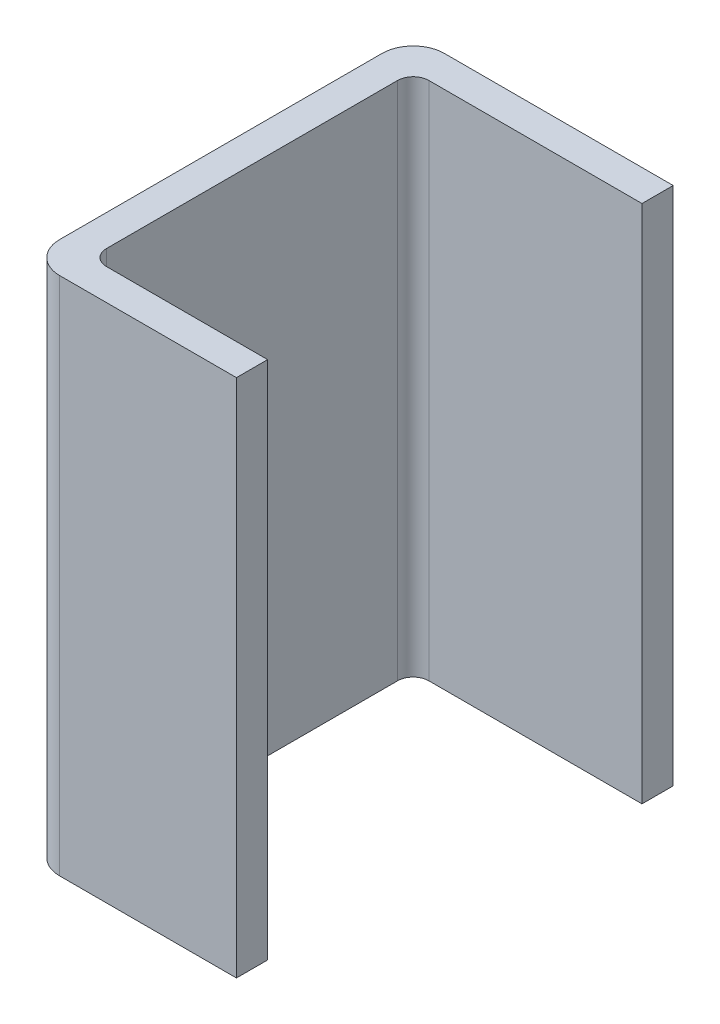
ISO-10303-21;
HEADER;
FILE_DESCRIPTION(('STEP AP214'),'2;1');
FILE_NAME('part.step','',(''),(''),'','','');
FILE_SCHEMA(('AUTOMOTIVE_DESIGN { 1 0 10303 214 1 1 1 1 }'));
ENDSEC;
DATA;
#1=APPLICATION_CONTEXT('core data for automotive mechanical design processes');
#2=APPLICATION_PROTOCOL_DEFINITION('international standard','automotive_design',2000,#1);
#3=PRODUCT_CONTEXT('',#1,'mechanical');
#4=PRODUCT('Part','Part','',(#3));
#5=PRODUCT_RELATED_PRODUCT_CATEGORY('part','',(#4));
#6=PRODUCT_DEFINITION_FORMATION('','',#4);
#7=PRODUCT_DEFINITION_CONTEXT('part definition',#1,'design');
#8=PRODUCT_DEFINITION('design','',#6,#7);
#9=PRODUCT_DEFINITION_SHAPE('','',#8);
#10=(LENGTH_UNIT() NAMED_UNIT(*) SI_UNIT(.MILLI.,.METRE.));
#11=(NAMED_UNIT(*) PLANE_ANGLE_UNIT() SI_UNIT($,.RADIAN.));
#12=(NAMED_UNIT(*) SI_UNIT($,.STERADIAN.) SOLID_ANGLE_UNIT());
#13=UNCERTAINTY_MEASURE_WITH_UNIT(LENGTH_MEASURE(1.E-05),#10,'distance_accuracy_value','');
#14=(GEOMETRIC_REPRESENTATION_CONTEXT(3) GLOBAL_UNCERTAINTY_ASSIGNED_CONTEXT((#13)) GLOBAL_UNIT_ASSIGNED_CONTEXT((#10,
#11,#12)) REPRESENTATION_CONTEXT('',''));
#15=CARTESIAN_POINT('',(0.,0.,0.));
#16=DIRECTION('',(0.,0.,1.));
#17=DIRECTION('',(1.,0.,0.));
#18=AXIS2_PLACEMENT_3D('',#15,#16,#17);
#19=CARTESIAN_POINT('',(-0.375,-0.25,0.185));
#20=DIRECTION('',(0.,1.,0.));
#21=DIRECTION('',(0.,0.,1.));
#22=AXIS2_PLACEMENT_3D('',#19,#20,#21);
#23=PLANE('',#22);
#24=CARTESIAN_POINT('',(-0.47,-0.25,0.0300000000000002));
#25=DIRECTION('',(0.,-1.,0.));
#26=DIRECTION('',(0.,0.,-1.));
#27=AXIS2_PLACEMENT_3D('',#24,#25,#26);
#28=CIRCLE('',#27,0.03);
#29=CARTESIAN_POINT('',(-0.5,-0.25,0.0300000000000002));
#30=VERTEX_POINT('',#29);
#31=CARTESIAN_POINT('',(-0.47,-0.25,0.));
#32=VERTEX_POINT('',#31);
#33=EDGE_CURVE('E11',#30,#32,#28,.T.);
#34=ORIENTED_EDGE('',*,*,#33,.T.);
#35=DIRECTION('',(1.,0.,0.));
#36=VECTOR('',#35,1.);
#37=CARTESIAN_POINT('',(0.47,-0.25,0.));
#38=LINE('',#37,#36);
#39=CARTESIAN_POINT('',(-0.25,-0.25,0.));
#40=VERTEX_POINT('',#39);
#41=EDGE_CURVE('E24',#32,#40,#38,.T.);
#42=ORIENTED_EDGE('',*,*,#41,.T.);
#43=DIRECTION('',(0.,0.,1.));
#44=VECTOR('',#43,1.);
#45=CARTESIAN_POINT('',(-0.25,-0.25,0.0299999999999999));
#46=LINE('',#45,#44);
#47=CARTESIAN_POINT('',(-0.25,-0.25,0.03));
#48=VERTEX_POINT('',#47);
#49=EDGE_CURVE('E195',#40,#48,#46,.T.);
#50=ORIENTED_EDGE('',*,*,#49,.T.);
#51=DIRECTION('',(-1.,0.,0.));
#52=VECTOR('',#51,1.);
#53=CARTESIAN_POINT('',(-0.455000000000001,-0.25,0.03));
#54=LINE('',#53,#52);
#55=CARTESIAN_POINT('',(-0.455000000000001,-0.25,0.03));
#56=VERTEX_POINT('',#55);
#57=EDGE_CURVE('E193',#48,#56,#54,.T.);
#58=ORIENTED_EDGE('',*,*,#57,.T.);
#59=CARTESIAN_POINT('',(-0.455000000000001,-0.25,0.045));
#60=DIRECTION('',(0.,1.,0.));
#61=DIRECTION('',(0.,0.,1.));
#62=AXIS2_PLACEMENT_3D('',#59,#60,#61);
#63=CIRCLE('',#62,0.015);
#64=CARTESIAN_POINT('',(-0.47,-0.25,0.045));
#65=VERTEX_POINT('',#64);
#66=EDGE_CURVE('E191',#56,#65,#63,.T.);
#67=ORIENTED_EDGE('',*,*,#66,.T.);
#68=DIRECTION('',(0.,0.,1.));
#69=VECTOR('',#68,1.);
#70=CARTESIAN_POINT('',(-0.47,-0.25,0.325000000000001));
#71=LINE('',#70,#69);
#72=CARTESIAN_POINT('',(-0.47,-0.25,0.325000000000001));
#73=VERTEX_POINT('',#72);
#74=EDGE_CURVE('E189',#65,#73,#71,.T.);
#75=ORIENTED_EDGE('',*,*,#74,.T.);
#76=CARTESIAN_POINT('',(-0.455,-0.25,0.325000000000001));
#77=DIRECTION('',(0.,1.,0.));
#78=DIRECTION('',(1.,0.,0.));
#79=AXIS2_PLACEMENT_3D('',#76,#77,#78);
#80=CIRCLE('',#79,0.015);
#81=CARTESIAN_POINT('',(-0.455,-0.25,0.34));
#82=VERTEX_POINT('',#81);
#83=EDGE_CURVE('E187',#73,#82,#80,.T.);
#84=ORIENTED_EDGE('',*,*,#83,.T.);
#85=DIRECTION('',(1.,0.,0.));
#86=VECTOR('',#85,1.);
#87=CARTESIAN_POINT('',(0.455,-0.25,0.34));
#88=LINE('',#87,#86);
#89=CARTESIAN_POINT('',(-0.3,-0.25,0.34));
#90=VERTEX_POINT('',#89);
#91=EDGE_CURVE('E185',#82,#90,#88,.T.);
#92=ORIENTED_EDGE('',*,*,#91,.T.);
#93=DIRECTION('',(0.,0.,1.));
#94=VECTOR('',#93,1.);
#95=CARTESIAN_POINT('',(-0.3,-0.25,0.485812171735076));
#96=LINE('',#95,#94);
#97=CARTESIAN_POINT('',(-0.3,-0.25,0.37));
#98=VERTEX_POINT('',#97);
#99=EDGE_CURVE('E183',#90,#98,#96,.T.);
#100=ORIENTED_EDGE('',*,*,#99,.T.);
#101=DIRECTION('',(-1.,0.,0.));
#102=VECTOR('',#101,1.);
#103=CARTESIAN_POINT('',(-0.47,-0.25,0.37));
#104=LINE('',#103,#102);
#105=CARTESIAN_POINT('',(-0.47,-0.25,0.37));
#106=VERTEX_POINT('',#105);
#107=EDGE_CURVE('E181',#98,#106,#104,.T.);
#108=ORIENTED_EDGE('',*,*,#107,.T.);
#109=CARTESIAN_POINT('',(-0.47,-0.25,0.34));
#110=DIRECTION('',(0.,-1.,0.));
#111=DIRECTION('',(-1.,0.,0.));
#112=AXIS2_PLACEMENT_3D('',#109,#110,#111);
#113=CIRCLE('',#112,0.03);
#114=CARTESIAN_POINT('',(-0.5,-0.25,0.34));
#115=VERTEX_POINT('',#114);
#116=EDGE_CURVE('E179',#106,#115,#113,.T.);
#117=ORIENTED_EDGE('',*,*,#116,.T.);
#118=DIRECTION('',(0.,0.,-1.));
#119=VECTOR('',#118,1.);
#120=CARTESIAN_POINT('',(-0.5,-0.25,0.0300000000000002));
#121=LINE('',#120,#119);
#122=EDGE_CURVE('E177',#115,#30,#121,.T.);
#123=ORIENTED_EDGE('',*,*,#122,.T.);
#124=EDGE_LOOP('',(#34,#42,#50,#58,#67,#75,#84,#92,#100,#108,#117,#123));
#125=FACE_BOUND('',#124,.T.);
#126=ADVANCED_FACE('F17',(#125),#23,.F.);
#127=CARTESIAN_POINT('',(-0.25,0.,0.));
#128=DIRECTION('',(0.,0.,-1.));
#129=DIRECTION('',(-1.,0.,0.));
#130=AXIS2_PLACEMENT_3D('',#127,#128,#129);
#131=PLANE('',#130);
#132=DIRECTION('',(0.,-1.,0.));
#133=VECTOR('',#132,1.);
#134=CARTESIAN_POINT('',(-0.47,0.,0.));
#135=LINE('',#134,#133);
#136=CARTESIAN_POINT('',(-0.47,0.25,0.));
#137=VERTEX_POINT('',#136);
#138=EDGE_CURVE('E175',#137,#32,#135,.T.);
#139=ORIENTED_EDGE('',*,*,#138,.F.);
#140=DIRECTION('',(-1.,0.,0.));
#141=VECTOR('',#140,1.);
#142=CARTESIAN_POINT('',(0.47,0.25,0.));
#143=LINE('',#142,#141);
#144=CARTESIAN_POINT('',(-0.25,0.25,0.));
#145=VERTEX_POINT('',#144);
#146=EDGE_CURVE('E120',#145,#137,#143,.T.);
#147=ORIENTED_EDGE('',*,*,#146,.F.);
#148=DIRECTION('',(0.,1.,0.));
#149=VECTOR('',#148,1.);
#150=CARTESIAN_POINT('',(-0.25,0.,0.));
#151=LINE('',#150,#149);
#152=EDGE_CURVE('E171',#40,#145,#151,.T.);
#153=ORIENTED_EDGE('',*,*,#152,.F.);
#154=ORIENTED_EDGE('',*,*,#41,.F.);
#155=EDGE_LOOP('',(#139,#147,#153,#154));
#156=FACE_BOUND('',#155,.T.);
#157=ADVANCED_FACE('F203',(#156),#131,.T.);
#158=CARTESIAN_POINT('',(-0.25,0.,0.03));
#159=DIRECTION('',(1.,0.,0.));
#160=DIRECTION('',(0.,0.,-1.));
#161=AXIS2_PLACEMENT_3D('',#158,#159,#160);
#162=PLANE('',#161);
#163=ORIENTED_EDGE('',*,*,#152,.T.);
#164=DIRECTION('',(0.,0.,-1.));
#165=VECTOR('',#164,1.);
#166=CARTESIAN_POINT('',(-0.25,0.25,0.0299999999999999));
#167=LINE('',#166,#165);
#168=CARTESIAN_POINT('',(-0.25,0.25,0.03));
#169=VERTEX_POINT('',#168);
#170=EDGE_CURVE('E169',#169,#145,#167,.T.);
#171=ORIENTED_EDGE('',*,*,#170,.F.);
#172=DIRECTION('',(0.,1.,0.));
#173=VECTOR('',#172,1.);
#174=CARTESIAN_POINT('',(-0.25,0.,0.03));
#175=LINE('',#174,#173);
#176=EDGE_CURVE('E166',#48,#169,#175,.T.);
#177=ORIENTED_EDGE('',*,*,#176,.F.);
#178=ORIENTED_EDGE('',*,*,#49,.F.);
#179=EDGE_LOOP('',(#163,#171,#177,#178));
#180=FACE_BOUND('',#179,.T.);
#181=ADVANCED_FACE('F202',(#180),#162,.T.);
#182=CARTESIAN_POINT('',(-0.455000000000001,0.,0.03));
#183=DIRECTION('',(0.,0.,1.));
#184=DIRECTION('',(1.,0.,0.));
#185=AXIS2_PLACEMENT_3D('',#182,#183,#184);
#186=PLANE('',#185);
#187=ORIENTED_EDGE('',*,*,#176,.T.);
#188=DIRECTION('',(1.,0.,0.));
#189=VECTOR('',#188,1.);
#190=CARTESIAN_POINT('',(-0.455000000000001,0.25,0.03));
#191=LINE('',#190,#189);
#192=CARTESIAN_POINT('',(-0.455000000000001,0.25,0.03));
#193=VERTEX_POINT('',#192);
#194=EDGE_CURVE('E163',#193,#169,#191,.T.);
#195=ORIENTED_EDGE('',*,*,#194,.F.);
#196=DIRECTION('',(0.,1.,0.));
#197=VECTOR('',#196,1.);
#198=CARTESIAN_POINT('',(-0.455000000000001,0.,0.03));
#199=LINE('',#198,#197);
#200=EDGE_CURVE('E160',#56,#193,#199,.T.);
#201=ORIENTED_EDGE('',*,*,#200,.F.);
#202=ORIENTED_EDGE('',*,*,#57,.F.);
#203=EDGE_LOOP('',(#187,#195,#201,#202));
#204=FACE_BOUND('',#203,.T.);
#205=ADVANCED_FACE('F210',(#204),#186,.T.);
#206=CARTESIAN_POINT('',(-0.455000000000001,0.,0.045));
#207=DIRECTION('',(0.,1.,0.));
#208=DIRECTION('',(0.,0.,1.));
#209=AXIS2_PLACEMENT_3D('',#206,#207,#208);
#210=CYLINDRICAL_SURFACE('',#209,0.015);
#211=ORIENTED_EDGE('',*,*,#200,.T.);
#212=CARTESIAN_POINT('',(-0.455000000000001,0.25,0.045));
#213=DIRECTION('',(0.,-1.,0.));
#214=DIRECTION('',(0.,0.,1.));
#215=AXIS2_PLACEMENT_3D('',#212,#213,#214);
#216=CIRCLE('',#215,0.015);
#217=CARTESIAN_POINT('',(-0.47,0.25,0.045));
#218=VERTEX_POINT('',#217);
#219=EDGE_CURVE('E157',#218,#193,#216,.T.);
#220=ORIENTED_EDGE('',*,*,#219,.F.);
#221=DIRECTION('',(0.,1.,0.));
#222=VECTOR('',#221,1.);
#223=CARTESIAN_POINT('',(-0.47,0.,0.045));
#224=LINE('',#223,#222);
#225=EDGE_CURVE('E155',#65,#218,#224,.T.);
#226=ORIENTED_EDGE('',*,*,#225,.F.);
#227=ORIENTED_EDGE('',*,*,#66,.F.);
#228=EDGE_LOOP('',(#211,#220,#226,#227));
#229=FACE_BOUND('',#228,.T.);
#230=ADVANCED_FACE('F215',(#229),#210,.F.);
#231=CARTESIAN_POINT('',(-0.47,0.,0.325000000000001));
#232=DIRECTION('',(1.,0.,0.));
#233=DIRECTION('',(0.,0.,-1.));
#234=AXIS2_PLACEMENT_3D('',#231,#232,#233);
#235=PLANE('',#234);
#236=ORIENTED_EDGE('',*,*,#225,.T.);
#237=DIRECTION('',(0.,0.,-1.));
#238=VECTOR('',#237,1.);
#239=CARTESIAN_POINT('',(-0.47,0.25,0.325000000000001));
#240=LINE('',#239,#238);
#241=CARTESIAN_POINT('',(-0.47,0.25,0.325000000000001));
#242=VERTEX_POINT('',#241);
#243=EDGE_CURVE('E152',#242,#218,#240,.T.);
#244=ORIENTED_EDGE('',*,*,#243,.F.);
#245=DIRECTION('',(0.,1.,0.));
#246=VECTOR('',#245,1.);
#247=CARTESIAN_POINT('',(-0.47,0.,0.325000000000001));
#248=LINE('',#247,#246);
#249=EDGE_CURVE('E149',#73,#242,#248,.T.);
#250=ORIENTED_EDGE('',*,*,#249,.F.);
#251=ORIENTED_EDGE('',*,*,#74,.F.);
#252=EDGE_LOOP('',(#236,#244,#250,#251));
#253=FACE_BOUND('',#252,.T.);
#254=ADVANCED_FACE('F219',(#253),#235,.T.);
#255=CARTESIAN_POINT('',(-0.455,0.,0.325000000000001));
#256=DIRECTION('',(0.,1.,0.));
#257=DIRECTION('',(1.,0.,0.));
#258=AXIS2_PLACEMENT_3D('',#255,#256,#257);
#259=CYLINDRICAL_SURFACE('',#258,0.015);
#260=ORIENTED_EDGE('',*,*,#249,.T.);
#261=CARTESIAN_POINT('',(-0.455,0.25,0.325000000000001));
#262=DIRECTION('',(0.,-1.,0.));
#263=DIRECTION('',(1.,0.,0.));
#264=AXIS2_PLACEMENT_3D('',#261,#262,#263);
#265=CIRCLE('',#264,0.015);
#266=CARTESIAN_POINT('',(-0.455,0.25,0.34));
#267=VERTEX_POINT('',#266);
#268=EDGE_CURVE('E146',#267,#242,#265,.T.);
#269=ORIENTED_EDGE('',*,*,#268,.F.);
#270=DIRECTION('',(0.,1.,0.));
#271=VECTOR('',#270,1.);
#272=CARTESIAN_POINT('',(-0.455,0.,0.34));
#273=LINE('',#272,#271);
#274=EDGE_CURVE('E144',#82,#267,#273,.T.);
#275=ORIENTED_EDGE('',*,*,#274,.F.);
#276=ORIENTED_EDGE('',*,*,#83,.F.);
#277=EDGE_LOOP('',(#260,#269,#275,#276));
#278=FACE_BOUND('',#277,.T.);
#279=ADVANCED_FACE('F223',(#278),#259,.F.);
#280=CARTESIAN_POINT('',(-0.3,0.,0.34));
#281=DIRECTION('',(0.,0.,-1.));
#282=DIRECTION('',(-1.,0.,0.));
#283=AXIS2_PLACEMENT_3D('',#280,#281,#282);
#284=PLANE('',#283);
#285=ORIENTED_EDGE('',*,*,#274,.T.);
#286=DIRECTION('',(-1.,0.,0.));
#287=VECTOR('',#286,1.);
#288=CARTESIAN_POINT('',(0.455,0.25,0.34));
#289=LINE('',#288,#287);
#290=CARTESIAN_POINT('',(-0.3,0.25,0.34));
#291=VERTEX_POINT('',#290);
#292=EDGE_CURVE('E141',#291,#267,#289,.T.);
#293=ORIENTED_EDGE('',*,*,#292,.F.);
#294=DIRECTION('',(0.,1.,0.));
#295=VECTOR('',#294,1.);
#296=CARTESIAN_POINT('',(-0.3,0.,0.34));
#297=LINE('',#296,#295);
#298=EDGE_CURVE('E138',#90,#291,#297,.T.);
#299=ORIENTED_EDGE('',*,*,#298,.F.);
#300=ORIENTED_EDGE('',*,*,#91,.F.);
#301=EDGE_LOOP('',(#285,#293,#299,#300));
#302=FACE_BOUND('',#301,.T.);
#303=ADVANCED_FACE('F227',(#302),#284,.T.);
#304=CARTESIAN_POINT('',(-0.3,0.,0.37));
#305=DIRECTION('',(1.,0.,0.));
#306=DIRECTION('',(0.,0.,-1.));
#307=AXIS2_PLACEMENT_3D('',#304,#305,#306);
#308=PLANE('',#307);
#309=ORIENTED_EDGE('',*,*,#298,.T.);
#310=DIRECTION('',(0.,0.,-1.));
#311=VECTOR('',#310,1.);
#312=CARTESIAN_POINT('',(-0.3,0.25,0.485812171735076));
#313=LINE('',#312,#311);
#314=CARTESIAN_POINT('',(-0.3,0.25,0.37));
#315=VERTEX_POINT('',#314);
#316=EDGE_CURVE('E135',#315,#291,#313,.T.);
#317=ORIENTED_EDGE('',*,*,#316,.F.);
#318=DIRECTION('',(0.,1.,0.));
#319=VECTOR('',#318,1.);
#320=CARTESIAN_POINT('',(-0.3,0.,0.37));
#321=LINE('',#320,#319);
#322=EDGE_CURVE('E132',#98,#315,#321,.T.);
#323=ORIENTED_EDGE('',*,*,#322,.F.);
#324=ORIENTED_EDGE('',*,*,#99,.F.);
#325=EDGE_LOOP('',(#309,#317,#323,#324));
#326=FACE_BOUND('',#325,.T.);
#327=ADVANCED_FACE('F231',(#326),#308,.T.);
#328=CARTESIAN_POINT('',(-0.47,0.,0.37));
#329=DIRECTION('',(0.,0.,1.));
#330=DIRECTION('',(1.,0.,0.));
#331=AXIS2_PLACEMENT_3D('',#328,#329,#330);
#332=PLANE('',#331);
#333=ORIENTED_EDGE('',*,*,#322,.T.);
#334=DIRECTION('',(1.,0.,0.));
#335=VECTOR('',#334,1.);
#336=CARTESIAN_POINT('',(-0.47,0.25,0.37));
#337=LINE('',#336,#335);
#338=CARTESIAN_POINT('',(-0.47,0.25,0.37));
#339=VERTEX_POINT('',#338);
#340=EDGE_CURVE('E129',#339,#315,#337,.T.);
#341=ORIENTED_EDGE('',*,*,#340,.F.);
#342=DIRECTION('',(0.,1.,0.));
#343=VECTOR('',#342,1.);
#344=CARTESIAN_POINT('',(-0.47,0.,0.37));
#345=LINE('',#344,#343);
#346=EDGE_CURVE('E126',#106,#339,#345,.T.);
#347=ORIENTED_EDGE('',*,*,#346,.F.);
#348=ORIENTED_EDGE('',*,*,#107,.F.);
#349=EDGE_LOOP('',(#333,#341,#347,#348));
#350=FACE_BOUND('',#349,.T.);
#351=ADVANCED_FACE('F235',(#350),#332,.T.);
#352=CARTESIAN_POINT('',(-0.47,0.,0.34));
#353=DIRECTION('',(0.,1.,0.));
#354=DIRECTION('',(-1.,0.,0.));
#355=AXIS2_PLACEMENT_3D('',#352,#353,#354);
#356=CYLINDRICAL_SURFACE('',#355,0.03);
#357=ORIENTED_EDGE('',*,*,#346,.T.);
#358=CARTESIAN_POINT('',(-0.47,0.25,0.34));
#359=DIRECTION('',(0.,1.,0.));
#360=DIRECTION('',(-1.,0.,0.));
#361=AXIS2_PLACEMENT_3D('',#358,#359,#360);
#362=CIRCLE('',#361,0.03);
#363=CARTESIAN_POINT('',(-0.5,0.25,0.34));
#364=VERTEX_POINT('',#363);
#365=EDGE_CURVE('E124',#364,#339,#362,.T.);
#366=ORIENTED_EDGE('',*,*,#365,.F.);
#367=DIRECTION('',(0.,1.,0.));
#368=VECTOR('',#367,1.);
#369=CARTESIAN_POINT('',(-0.5,0.,0.34));
#370=LINE('',#369,#368);
#371=EDGE_CURVE('E108',#115,#364,#370,.T.);
#372=ORIENTED_EDGE('',*,*,#371,.F.);
#373=ORIENTED_EDGE('',*,*,#116,.F.);
#374=EDGE_LOOP('',(#357,#366,#372,#373));
#375=FACE_BOUND('',#374,.T.);
#376=ADVANCED_FACE('F239',(#375),#356,.T.);
#377=CARTESIAN_POINT('',(-0.5,0.,0.0300000000000002));
#378=DIRECTION('',(-1.,0.,0.));
#379=DIRECTION('',(0.,0.,1.));
#380=AXIS2_PLACEMENT_3D('',#377,#378,#379);
#381=PLANE('',#380);
#382=ORIENTED_EDGE('',*,*,#371,.T.);
#383=DIRECTION('',(0.,0.,1.));
#384=VECTOR('',#383,1.);
#385=CARTESIAN_POINT('',(-0.5,0.25,0.0300000000000002));
#386=LINE('',#385,#384);
#387=CARTESIAN_POINT('',(-0.5,0.25,0.0300000000000002));
#388=VERTEX_POINT('',#387);
#389=EDGE_CURVE('E103',#388,#364,#386,.T.);
#390=ORIENTED_EDGE('',*,*,#389,.F.);
#391=DIRECTION('',(0.,1.,0.));
#392=VECTOR('',#391,1.);
#393=CARTESIAN_POINT('',(-0.5,0.,0.0300000000000002));
#394=LINE('',#393,#392);
#395=EDGE_CURVE('E106',#30,#388,#394,.T.);
#396=ORIENTED_EDGE('',*,*,#395,.F.);
#397=ORIENTED_EDGE('',*,*,#122,.F.);
#398=EDGE_LOOP('',(#382,#390,#396,#397));
#399=FACE_BOUND('',#398,.T.);
#400=ADVANCED_FACE('F104',(#399),#381,.T.);
#401=CARTESIAN_POINT('',(-0.47,0.,0.0300000000000002));
#402=DIRECTION('',(0.,1.,0.));
#403=DIRECTION('',(0.,0.,-1.));
#404=AXIS2_PLACEMENT_3D('',#401,#402,#403);
#405=CYLINDRICAL_SURFACE('',#404,0.03);
#406=ORIENTED_EDGE('',*,*,#395,.T.);
#407=CARTESIAN_POINT('',(-0.47,0.25,0.0300000000000002));
#408=DIRECTION('',(0.,1.,0.));
#409=DIRECTION('',(0.,0.,-1.));
#410=AXIS2_PLACEMENT_3D('',#407,#408,#409);
#411=CIRCLE('',#410,0.03);
#412=EDGE_CURVE('E115',#137,#388,#411,.T.);
#413=ORIENTED_EDGE('',*,*,#412,.F.);
#414=ORIENTED_EDGE('',*,*,#138,.T.);
#415=ORIENTED_EDGE('',*,*,#33,.F.);
#416=EDGE_LOOP('',(#406,#413,#414,#415));
#417=FACE_BOUND('',#416,.T.);
#418=ADVANCED_FACE('F114',(#417),#405,.T.);
#419=CARTESIAN_POINT('',(-0.375,0.25,0.185));
#420=DIRECTION('',(0.,1.,0.));
#421=DIRECTION('',(0.,0.,1.));
#422=AXIS2_PLACEMENT_3D('',#419,#420,#421);
#423=PLANE('',#422);
#424=ORIENTED_EDGE('',*,*,#412,.T.);
#425=ORIENTED_EDGE('',*,*,#389,.T.);
#426=ORIENTED_EDGE('',*,*,#365,.T.);
#427=ORIENTED_EDGE('',*,*,#340,.T.);
#428=ORIENTED_EDGE('',*,*,#316,.T.);
#429=ORIENTED_EDGE('',*,*,#292,.T.);
#430=ORIENTED_EDGE('',*,*,#268,.T.);
#431=ORIENTED_EDGE('',*,*,#243,.T.);
#432=ORIENTED_EDGE('',*,*,#219,.T.);
#433=ORIENTED_EDGE('',*,*,#194,.T.);
#434=ORIENTED_EDGE('',*,*,#170,.T.);
#435=ORIENTED_EDGE('',*,*,#146,.T.);
#436=EDGE_LOOP('',(#424,#425,#426,#427,#428,#429,#430,#431,#432,#433,#434,#435));
#437=FACE_BOUND('',#436,.T.);
#438=ADVANCED_FACE('F118',(#437),#423,.T.);
#439=CLOSED_SHELL('',(#126,#157,#181,#205,#230,#254,#279,#303,#327,#351,#376,#400,#418,#438));
#440=MANIFOLD_SOLID_BREP('B1',#439);
#441=ADVANCED_BREP_SHAPE_REPRESENTATION('',(#18,#440),#14);
#442=SHAPE_DEFINITION_REPRESENTATION(#9,#441);
ENDSEC;
END-ISO-10303-21;
